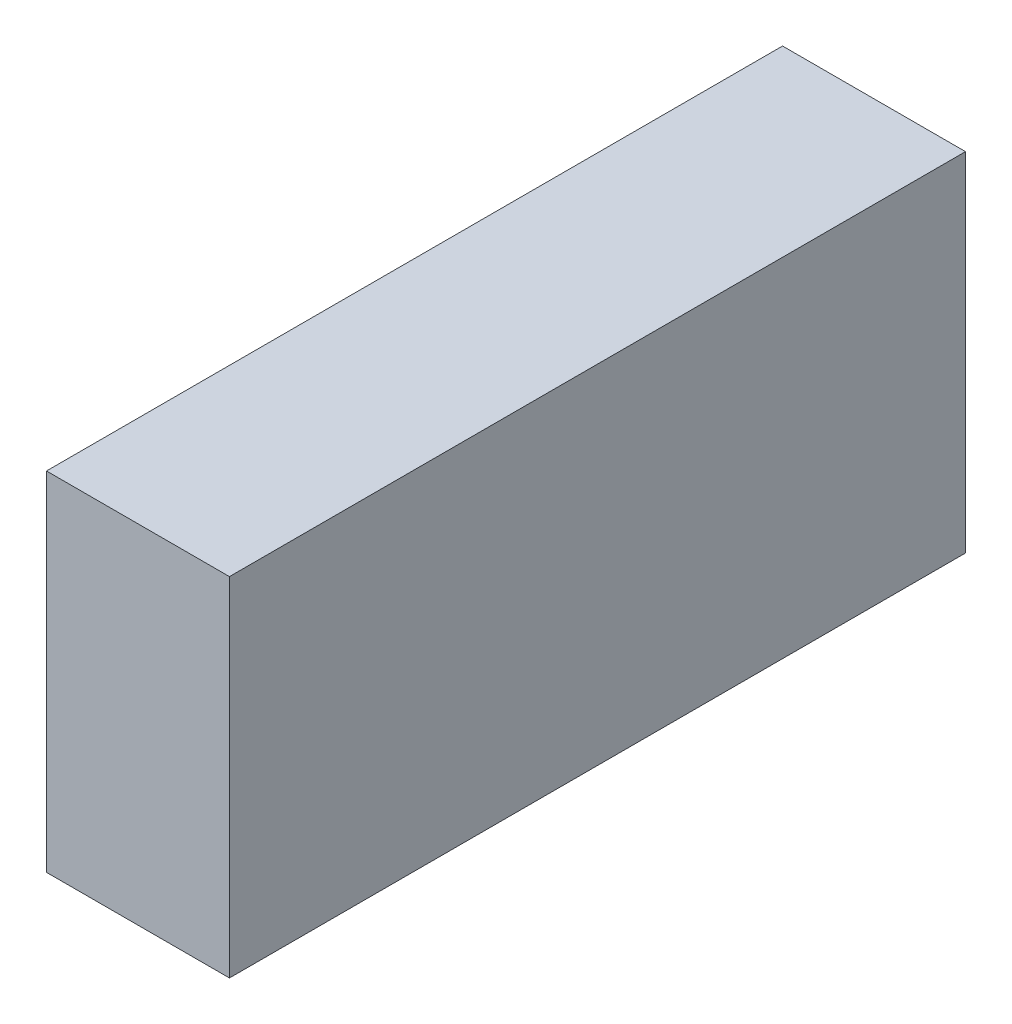
ISO-10303-21;
HEADER;
FILE_DESCRIPTION(('STEP AP214'),'2;1');
FILE_NAME('part.step','',(''),(''),'','','');
FILE_SCHEMA(('AUTOMOTIVE_DESIGN { 1 0 10303 214 1 1 1 1 }'));
ENDSEC;
DATA;
#1=APPLICATION_CONTEXT('core data for automotive mechanical design processes');
#2=APPLICATION_PROTOCOL_DEFINITION('international standard','automotive_design',2000,#1);
#3=PRODUCT_CONTEXT('',#1,'mechanical');
#4=PRODUCT('Part','Part','',(#3));
#5=PRODUCT_RELATED_PRODUCT_CATEGORY('part','',(#4));
#6=PRODUCT_DEFINITION_FORMATION('','',#4);
#7=PRODUCT_DEFINITION_CONTEXT('part definition',#1,'design');
#8=PRODUCT_DEFINITION('design','',#6,#7);
#9=PRODUCT_DEFINITION_SHAPE('','',#8);
#10=(LENGTH_UNIT() NAMED_UNIT(*) SI_UNIT(.MILLI.,.METRE.));
#11=(NAMED_UNIT(*) PLANE_ANGLE_UNIT() SI_UNIT($,.RADIAN.));
#12=(NAMED_UNIT(*) SI_UNIT($,.STERADIAN.) SOLID_ANGLE_UNIT());
#13=UNCERTAINTY_MEASURE_WITH_UNIT(LENGTH_MEASURE(1.E-05),#10,'distance_accuracy_value','');
#14=(GEOMETRIC_REPRESENTATION_CONTEXT(3) GLOBAL_UNCERTAINTY_ASSIGNED_CONTEXT((#13)) GLOBAL_UNIT_ASSIGNED_CONTEXT((#10,
#11,#12)) REPRESENTATION_CONTEXT('',''));
#15=CARTESIAN_POINT('',(0.,0.,0.));
#16=DIRECTION('',(0.,0.,1.));
#17=DIRECTION('',(1.,0.,0.));
#18=AXIS2_PLACEMENT_3D('',#15,#16,#17);
#19=CARTESIAN_POINT('',(-7.86390728476821,15.3703642384106,52.3));
#20=DIRECTION('',(1.,0.,0.));
#21=DIRECTION('',(0.,1.,0.));
#22=AXIS2_PLACEMENT_3D('',#19,#20,#21);
#23=PLANE('',#22);
#24=DIRECTION('',(0.,-1.,0.));
#25=VECTOR('',#24,1.);
#26=CARTESIAN_POINT('',(-7.86390728476821,15.3703642384106,0.));
#27=LINE('',#26,#25);
#28=CARTESIAN_POINT('',(-7.86390728476821,15.3703642384106,0.));
#29=VERTEX_POINT('',#28);
#30=CARTESIAN_POINT('',(-7.86390728476821,-9.32963576158939,0.));
#31=VERTEX_POINT('',#30);
#32=EDGE_CURVE('E94',#29,#31,#27,.T.);
#33=ORIENTED_EDGE('',*,*,#32,.T.);
#34=DIRECTION('',(0.,0.,-1.));
#35=VECTOR('',#34,1.);
#36=CARTESIAN_POINT('',(-7.86390728476821,-9.32963576158939,52.3));
#37=LINE('',#36,#35);
#38=CARTESIAN_POINT('',(-7.86390728476821,-9.32963576158939,52.3));
#39=VERTEX_POINT('',#38);
#40=EDGE_CURVE('E11',#39,#31,#37,.T.);
#41=ORIENTED_EDGE('',*,*,#40,.F.);
#42=DIRECTION('',(0.,-1.,0.));
#43=VECTOR('',#42,1.);
#44=CARTESIAN_POINT('',(-7.86390728476821,15.3703642384106,52.3));
#45=LINE('',#44,#43);
#46=CARTESIAN_POINT('',(-7.86390728476821,15.3703642384106,52.3));
#47=VERTEX_POINT('',#46);
#48=EDGE_CURVE('E82',#47,#39,#45,.T.);
#49=ORIENTED_EDGE('',*,*,#48,.F.);
#50=DIRECTION('',(0.,0.,-1.));
#51=VECTOR('',#50,1.);
#52=CARTESIAN_POINT('',(-7.86390728476821,15.3703642384106,52.3));
#53=LINE('',#52,#51);
#54=EDGE_CURVE('E90',#47,#29,#53,.T.);
#55=ORIENTED_EDGE('',*,*,#54,.T.);
#56=EDGE_LOOP('',(#33,#41,#49,#55));
#57=FACE_BOUND('',#56,.T.);
#58=ADVANCED_FACE('F31',(#57),#23,.F.);
#59=CARTESIAN_POINT('',(-7.86390728476821,-9.32963576158939,52.3));
#60=DIRECTION('',(0.,1.,0.));
#61=DIRECTION('',(0.,0.,1.));
#62=AXIS2_PLACEMENT_3D('',#59,#60,#61);
#63=PLANE('',#62);
#64=DIRECTION('',(1.,0.,0.));
#65=VECTOR('',#64,1.);
#66=CARTESIAN_POINT('',(-7.86390728476821,-9.32963576158939,0.));
#67=LINE('',#66,#65);
#68=CARTESIAN_POINT('',(5.13609271523179,-9.32963576158939,0.));
#69=VERTEX_POINT('',#68);
#70=EDGE_CURVE('E86',#31,#69,#67,.T.);
#71=ORIENTED_EDGE('',*,*,#70,.T.);
#72=DIRECTION('',(0.,0.,-1.));
#73=VECTOR('',#72,1.);
#74=CARTESIAN_POINT('',(5.13609271523179,-9.32963576158939,52.3));
#75=LINE('',#74,#73);
#76=CARTESIAN_POINT('',(5.13609271523179,-9.32963576158939,52.3));
#77=VERTEX_POINT('',#76);
#78=EDGE_CURVE('E39',#77,#69,#75,.T.);
#79=ORIENTED_EDGE('',*,*,#78,.F.);
#80=DIRECTION('',(1.,0.,0.));
#81=VECTOR('',#80,1.);
#82=CARTESIAN_POINT('',(-7.86390728476821,-9.32963576158939,52.3));
#83=LINE('',#82,#81);
#84=EDGE_CURVE('E77',#39,#77,#83,.T.);
#85=ORIENTED_EDGE('',*,*,#84,.F.);
#86=ORIENTED_EDGE('',*,*,#40,.T.);
#87=EDGE_LOOP('',(#71,#79,#85,#86));
#88=FACE_BOUND('',#87,.T.);
#89=ADVANCED_FACE('F85',(#88),#63,.F.);
#90=CARTESIAN_POINT('',(5.13609271523178,15.3703642384106,52.3));
#91=DIRECTION('',(-1.,0.,0.));
#92=DIRECTION('',(0.,-1.,0.));
#93=AXIS2_PLACEMENT_3D('',#90,#91,#92);
#94=PLANE('',#93);
#95=DIRECTION('',(0.,1.,0.));
#96=VECTOR('',#95,1.);
#97=CARTESIAN_POINT('',(5.13609271523178,15.3703642384106,0.));
#98=LINE('',#97,#96);
#99=CARTESIAN_POINT('',(5.13609271523178,15.3703642384106,0.));
#100=VERTEX_POINT('',#99);
#101=EDGE_CURVE('E64',#69,#100,#98,.T.);
#102=ORIENTED_EDGE('',*,*,#101,.T.);
#103=DIRECTION('',(0.,0.,-1.));
#104=VECTOR('',#103,1.);
#105=CARTESIAN_POINT('',(5.13609271523178,15.3703642384106,52.3));
#106=LINE('',#105,#104);
#107=CARTESIAN_POINT('',(5.13609271523178,15.3703642384106,52.3));
#108=VERTEX_POINT('',#107);
#109=EDGE_CURVE('E87',#108,#100,#106,.T.);
#110=ORIENTED_EDGE('',*,*,#109,.F.);
#111=DIRECTION('',(0.,1.,0.));
#112=VECTOR('',#111,1.);
#113=CARTESIAN_POINT('',(5.13609271523178,15.3703642384106,52.3));
#114=LINE('',#113,#112);
#115=EDGE_CURVE('E80',#77,#108,#114,.T.);
#116=ORIENTED_EDGE('',*,*,#115,.F.);
#117=ORIENTED_EDGE('',*,*,#78,.T.);
#118=EDGE_LOOP('',(#102,#110,#116,#117));
#119=FACE_BOUND('',#118,.T.);
#120=ADVANCED_FACE('F88',(#119),#94,.F.);
#121=CARTESIAN_POINT('',(-7.86390728476821,15.3703642384106,52.3));
#122=DIRECTION('',(0.,-1.,0.));
#123=DIRECTION('',(0.,0.,-1.));
#124=AXIS2_PLACEMENT_3D('',#121,#122,#123);
#125=PLANE('',#124);
#126=DIRECTION('',(-1.,0.,0.));
#127=VECTOR('',#126,1.);
#128=CARTESIAN_POINT('',(-7.86390728476821,15.3703642384106,0.));
#129=LINE('',#128,#127);
#130=EDGE_CURVE('E70',#100,#29,#129,.T.);
#131=ORIENTED_EDGE('',*,*,#130,.T.);
#132=ORIENTED_EDGE('',*,*,#54,.F.);
#133=DIRECTION('',(-1.,0.,0.));
#134=VECTOR('',#133,1.);
#135=CARTESIAN_POINT('',(-7.86390728476821,15.3703642384106,52.3));
#136=LINE('',#135,#134);
#137=EDGE_CURVE('E47',#108,#47,#136,.T.);
#138=ORIENTED_EDGE('',*,*,#137,.F.);
#139=ORIENTED_EDGE('',*,*,#109,.T.);
#140=EDGE_LOOP('',(#131,#132,#138,#139));
#141=FACE_BOUND('',#140,.T.);
#142=ADVANCED_FACE('F101',(#141),#125,.F.);
#143=CARTESIAN_POINT('',(-7.86390728476821,-9.32963576158939,52.3));
#144=DIRECTION('',(0.,0.,1.));
#145=DIRECTION('',(1.,0.,0.));
#146=AXIS2_PLACEMENT_3D('',#143,#144,#145);
#147=PLANE('',#146);
#148=ORIENTED_EDGE('',*,*,#48,.T.);
#149=ORIENTED_EDGE('',*,*,#84,.T.);
#150=ORIENTED_EDGE('',*,*,#115,.T.);
#151=ORIENTED_EDGE('',*,*,#137,.T.);
#152=EDGE_LOOP('',(#148,#149,#150,#151));
#153=FACE_BOUND('',#152,.T.);
#154=ADVANCED_FACE('F78',(#153),#147,.T.);
#155=CARTESIAN_POINT('',(-7.86390728476821,-9.32963576158939,0.));
#156=DIRECTION('',(0.,0.,1.));
#157=DIRECTION('',(1.,0.,0.));
#158=AXIS2_PLACEMENT_3D('',#155,#156,#157);
#159=PLANE('',#158);
#160=ORIENTED_EDGE('',*,*,#32,.F.);
#161=ORIENTED_EDGE('',*,*,#130,.F.);
#162=ORIENTED_EDGE('',*,*,#101,.F.);
#163=ORIENTED_EDGE('',*,*,#70,.F.);
#164=EDGE_LOOP('',(#160,#161,#162,#163));
#165=FACE_BOUND('',#164,.T.);
#166=ADVANCED_FACE('F104',(#165),#159,.F.);
#167=CLOSED_SHELL('',(#58,#89,#120,#142,#154,#166));
#168=MANIFOLD_SOLID_BREP('B2',#167);
#169=ADVANCED_BREP_SHAPE_REPRESENTATION('',(#18,#168),#14);
#170=SHAPE_DEFINITION_REPRESENTATION(#9,#169);
ENDSEC;
END-ISO-10303-21;
